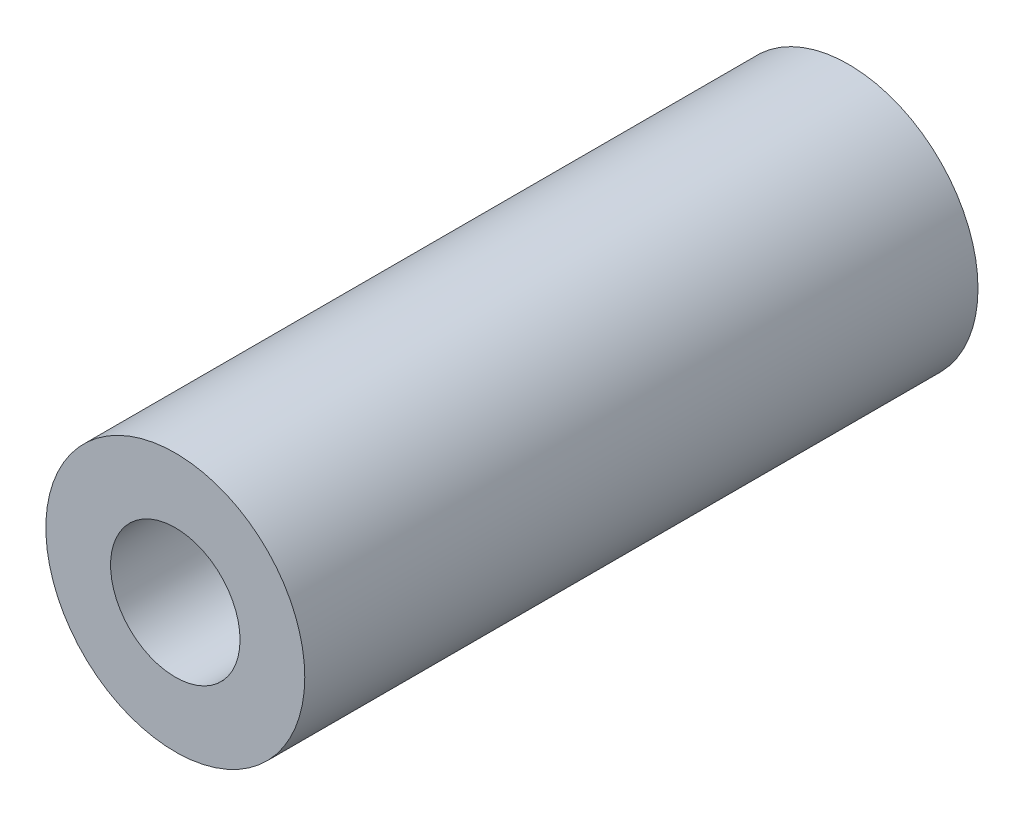
ISO-10303-21;
HEADER;
FILE_DESCRIPTION(('STEP AP214'),'2;1');
FILE_NAME('part.step','',(''),(''),'','','');
FILE_SCHEMA(('AUTOMOTIVE_DESIGN { 1 0 10303 214 1 1 1 1 }'));
ENDSEC;
DATA;
#1=APPLICATION_CONTEXT('core data for automotive mechanical design processes');
#2=APPLICATION_PROTOCOL_DEFINITION('international standard','automotive_design',2000,#1);
#3=PRODUCT_CONTEXT('',#1,'mechanical');
#4=PRODUCT('Part','Part','',(#3));
#5=PRODUCT_RELATED_PRODUCT_CATEGORY('part','',(#4));
#6=PRODUCT_DEFINITION_FORMATION('','',#4);
#7=PRODUCT_DEFINITION_CONTEXT('part definition',#1,'design');
#8=PRODUCT_DEFINITION('design','',#6,#7);
#9=PRODUCT_DEFINITION_SHAPE('','',#8);
#10=(LENGTH_UNIT() NAMED_UNIT(*) SI_UNIT(.MILLI.,.METRE.));
#11=(NAMED_UNIT(*) PLANE_ANGLE_UNIT() SI_UNIT($,.RADIAN.));
#12=(NAMED_UNIT(*) SI_UNIT($,.STERADIAN.) SOLID_ANGLE_UNIT());
#13=UNCERTAINTY_MEASURE_WITH_UNIT(LENGTH_MEASURE(1.E-05),#10,'distance_accuracy_value','');
#14=(GEOMETRIC_REPRESENTATION_CONTEXT(3) GLOBAL_UNCERTAINTY_ASSIGNED_CONTEXT((#13)) GLOBAL_UNIT_ASSIGNED_CONTEXT((#10,
#11,#12)) REPRESENTATION_CONTEXT('',''));
#15=CARTESIAN_POINT('',(0.,0.,0.));
#16=DIRECTION('',(0.,0.,1.));
#17=DIRECTION('',(1.,0.,0.));
#18=AXIS2_PLACEMENT_3D('',#15,#16,#17);
#19=CARTESIAN_POINT('',(0.,0.,13.));
#20=DIRECTION('',(0.,0.,1.));
#21=DIRECTION('',(1.,0.,0.));
#22=AXIS2_PLACEMENT_3D('',#19,#20,#21);
#23=PLANE('',#22);
#24=CARTESIAN_POINT('',(0.,0.,13.));
#25=DIRECTION('',(0.,0.,1.));
#26=DIRECTION('',(1.,0.,0.));
#27=AXIS2_PLACEMENT_3D('',#24,#25,#26);
#28=CIRCLE('',#27,2.5);
#29=CARTESIAN_POINT('',(2.5,0.,13.));
#30=VERTEX_POINT('',#29);
#31=EDGE_CURVE('E10',#30,#30,#28,.T.);
#32=ORIENTED_EDGE('',*,*,#31,.T.);
#33=EDGE_LOOP('',(#32));
#34=FACE_BOUND('',#33,.T.);
#35=CARTESIAN_POINT('',(0.,0.,13.));
#36=DIRECTION('',(0.,0.,1.));
#37=DIRECTION('',(1.,0.,0.));
#38=AXIS2_PLACEMENT_3D('',#35,#36,#37);
#39=CIRCLE('',#38,1.25);
#40=CARTESIAN_POINT('',(1.25,0.,13.));
#41=VERTEX_POINT('',#40);
#42=EDGE_CURVE('E41',#41,#41,#39,.T.);
#43=ORIENTED_EDGE('',*,*,#42,.F.);
#44=EDGE_LOOP('',(#43));
#45=FACE_BOUND('',#44,.T.);
#46=ADVANCED_FACE('F30',(#34,#45),#23,.T.);
#47=CARTESIAN_POINT('',(0.,0.,0.));
#48=DIRECTION('',(0.,0.,1.));
#49=DIRECTION('',(1.,0.,0.));
#50=AXIS2_PLACEMENT_3D('',#47,#48,#49);
#51=PLANE('',#50);
#52=CARTESIAN_POINT('',(0.,0.,0.));
#53=DIRECTION('',(0.,0.,1.));
#54=DIRECTION('',(1.,0.,0.));
#55=AXIS2_PLACEMENT_3D('',#52,#53,#54);
#56=CIRCLE('',#55,2.5);
#57=CARTESIAN_POINT('',(2.5,0.,0.));
#58=VERTEX_POINT('',#57);
#59=EDGE_CURVE('E34',#58,#58,#56,.T.);
#60=ORIENTED_EDGE('',*,*,#59,.F.);
#61=EDGE_LOOP('',(#60));
#62=FACE_BOUND('',#61,.T.);
#63=CARTESIAN_POINT('',(0.,0.,0.));
#64=DIRECTION('',(0.,0.,1.));
#65=DIRECTION('',(1.,0.,0.));
#66=AXIS2_PLACEMENT_3D('',#63,#64,#65);
#67=CIRCLE('',#66,1.25);
#68=CARTESIAN_POINT('',(1.25,0.,0.));
#69=VERTEX_POINT('',#68);
#70=EDGE_CURVE('E43',#69,#69,#67,.T.);
#71=ORIENTED_EDGE('',*,*,#70,.T.);
#72=EDGE_LOOP('',(#71));
#73=FACE_BOUND('',#72,.T.);
#74=ADVANCED_FACE('F53',(#62,#73),#51,.F.);
#75=CARTESIAN_POINT('',(0.,0.,13.));
#76=DIRECTION('',(0.,0.,-1.));
#77=DIRECTION('',(-1.,0.,0.));
#78=AXIS2_PLACEMENT_3D('',#75,#76,#77);
#79=CYLINDRICAL_SURFACE('',#78,2.5);
#80=ORIENTED_EDGE('',*,*,#31,.F.);
#81=EDGE_LOOP('',(#80));
#82=FACE_BOUND('',#81,.T.);
#83=ORIENTED_EDGE('',*,*,#59,.T.);
#84=EDGE_LOOP('',(#83));
#85=FACE_BOUND('',#84,.T.);
#86=ADVANCED_FACE('F32',(#82,#85),#79,.T.);
#87=CARTESIAN_POINT('',(0.,0.,13.));
#88=DIRECTION('',(0.,0.,-1.));
#89=DIRECTION('',(-1.,0.,0.));
#90=AXIS2_PLACEMENT_3D('',#87,#88,#89);
#91=CYLINDRICAL_SURFACE('',#90,1.25);
#92=ORIENTED_EDGE('',*,*,#42,.T.);
#93=EDGE_LOOP('',(#92));
#94=FACE_BOUND('',#93,.T.);
#95=ORIENTED_EDGE('',*,*,#70,.F.);
#96=EDGE_LOOP('',(#95));
#97=FACE_BOUND('',#96,.T.);
#98=ADVANCED_FACE('F49',(#94,#97),#91,.F.);
#99=CLOSED_SHELL('',(#46,#74,#86,#98));
#100=MANIFOLD_SOLID_BREP('B2',#99);
#101=ADVANCED_BREP_SHAPE_REPRESENTATION('',(#18,#100),#14);
#102=SHAPE_DEFINITION_REPRESENTATION(#9,#101);
ENDSEC;
END-ISO-10303-21;
